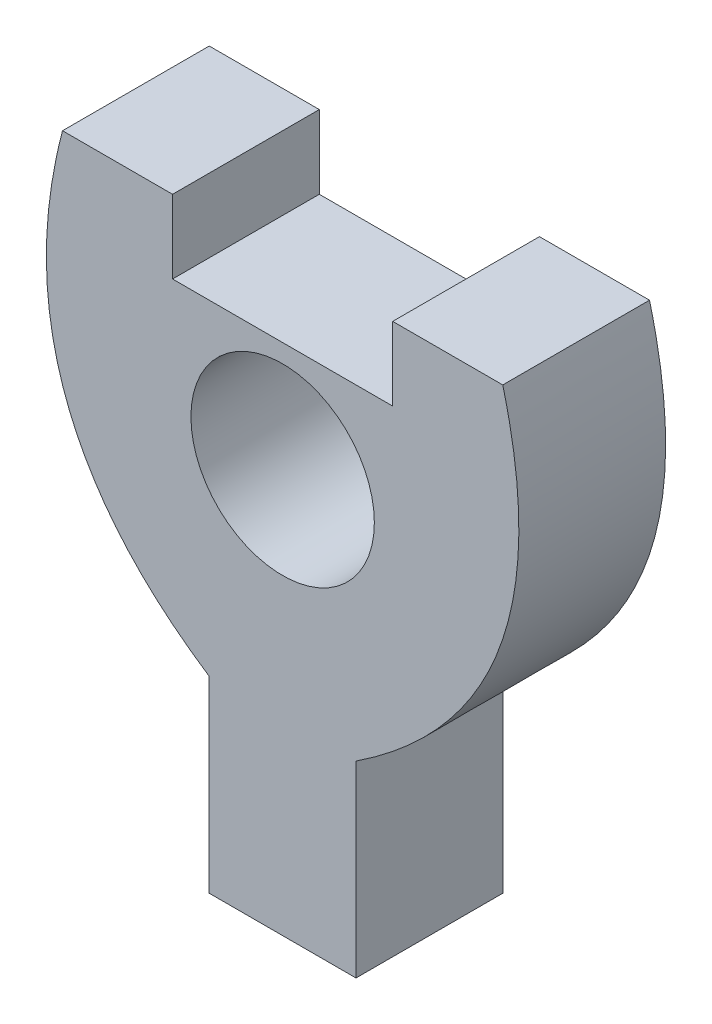
ISO-10303-21;
HEADER;
FILE_DESCRIPTION(('STEP AP214'),'2;1');
FILE_NAME('part.step','',(''),(''),'','','');
FILE_SCHEMA(('AUTOMOTIVE_DESIGN { 1 0 10303 214 1 1 1 1 }'));
ENDSEC;
DATA;
#1=APPLICATION_CONTEXT('core data for automotive mechanical design processes');
#2=APPLICATION_PROTOCOL_DEFINITION('international standard','automotive_design',2000,#1);
#3=PRODUCT_CONTEXT('',#1,'mechanical');
#4=PRODUCT('Part','Part','',(#3));
#5=PRODUCT_RELATED_PRODUCT_CATEGORY('part','',(#4));
#6=PRODUCT_DEFINITION_FORMATION('','',#4);
#7=PRODUCT_DEFINITION_CONTEXT('part definition',#1,'design');
#8=PRODUCT_DEFINITION('design','',#6,#7);
#9=PRODUCT_DEFINITION_SHAPE('','',#8);
#10=(LENGTH_UNIT() NAMED_UNIT(*) SI_UNIT(.MILLI.,.METRE.));
#11=(NAMED_UNIT(*) PLANE_ANGLE_UNIT() SI_UNIT($,.RADIAN.));
#12=(NAMED_UNIT(*) SI_UNIT($,.STERADIAN.) SOLID_ANGLE_UNIT());
#13=UNCERTAINTY_MEASURE_WITH_UNIT(LENGTH_MEASURE(1.E-05),#10,'distance_accuracy_value','');
#14=(GEOMETRIC_REPRESENTATION_CONTEXT(3) GLOBAL_UNCERTAINTY_ASSIGNED_CONTEXT((#13)) GLOBAL_UNIT_ASSIGNED_CONTEXT((#10,
#11,#12)) REPRESENTATION_CONTEXT('',''));
#15=CARTESIAN_POINT('',(0.,0.,0.));
#16=DIRECTION('',(0.,0.,1.));
#17=DIRECTION('',(1.,0.,0.));
#18=AXIS2_PLACEMENT_3D('',#15,#16,#17);
#19=CARTESIAN_POINT('',(0.,0.,4.));
#20=CARTESIAN_POINT('',(-8.12132034355964,3.87867965644036,4.));
#21=CARTESIAN_POINT('',(-6.,12.,4.));
#22=B_SPLINE_CURVE_WITH_KNOTS('',2,(#19,#20,#21),.UNSPECIFIED.,.F.,.F.,(3,3),(0.,1.),.UNSPECIFIED.);
#23=DIRECTION('',(0.,0.,-1.));
#24=VECTOR('',#23,1.);
#25=SURFACE_OF_LINEAR_EXTRUSION('',#22,#24);
#26=CARTESIAN_POINT('',(0.,0.,0.));
#27=CARTESIAN_POINT('',(-8.12132034355964,3.87867965644036,0.));
#28=CARTESIAN_POINT('',(-6.,12.,0.));
#29=B_SPLINE_CURVE_WITH_KNOTS('',2,(#26,#27,#28),.UNSPECIFIED.,.F.,.F.,(3,3),(0.,1.),.UNSPECIFIED.);
#30=CARTESIAN_POINT('',(-2.00000000009146,1.12054859730162,0.));
#31=VERTEX_POINT('',#30);
#32=CARTESIAN_POINT('',(-6.,12.,0.));
#33=VERTEX_POINT('',#32);
#34=EDGE_CURVE('E148',#31,#33,#29,.T.);
#35=ORIENTED_EDGE('',*,*,#34,.F.);
#36=DIRECTION('',(0.,0.,-1.));
#37=VECTOR('',#36,1.);
#38=CARTESIAN_POINT('',(-2.00000000009146,1.12054859730162,4.));
#39=LINE('',#38,#37);
#40=CARTESIAN_POINT('',(-2.00000000009146,1.12054859730162,4.));
#41=VERTEX_POINT('',#40);
#42=EDGE_CURVE('E11',#41,#31,#39,.T.);
#43=ORIENTED_EDGE('',*,*,#42,.F.);
#44=CARTESIAN_POINT('',(-6.,12.,4.));
#45=VERTEX_POINT('',#44);
#46=EDGE_CURVE('E184',#41,#45,#22,.T.);
#47=ORIENTED_EDGE('',*,*,#46,.T.);
#48=DIRECTION('',(0.,0.,-1.));
#49=VECTOR('',#48,1.);
#50=CARTESIAN_POINT('',(-6.,12.,4.));
#51=LINE('',#50,#49);
#52=EDGE_CURVE('E53',#45,#33,#51,.T.);
#53=ORIENTED_EDGE('',*,*,#52,.T.);
#54=EDGE_LOOP('',(#35,#43,#47,#53));
#55=FACE_BOUND('',#54,.T.);
#56=ADVANCED_FACE('F36',(#55),#25,.T.);
#57=CARTESIAN_POINT('',(-2.,0.,4.));
#58=DIRECTION('',(1.,0.,0.));
#59=DIRECTION('',(0.,1.,0.));
#60=AXIS2_PLACEMENT_3D('',#57,#58,#59);
#61=PLANE('',#60);
#62=DIRECTION('',(0.,-1.,0.));
#63=VECTOR('',#62,1.);
#64=CARTESIAN_POINT('',(-2.,0.,0.));
#65=LINE('',#64,#63);
#66=CARTESIAN_POINT('',(-2.,-4.,0.));
#67=VERTEX_POINT('',#66);
#68=EDGE_CURVE('E152',#31,#67,#65,.T.);
#69=ORIENTED_EDGE('',*,*,#68,.T.);
#70=DIRECTION('',(0.,0.,-1.));
#71=VECTOR('',#70,1.);
#72=CARTESIAN_POINT('',(-2.,-4.,4.));
#73=LINE('',#72,#71);
#74=CARTESIAN_POINT('',(-2.,-4.,4.));
#75=VERTEX_POINT('',#74);
#76=EDGE_CURVE('E45',#75,#67,#73,.T.);
#77=ORIENTED_EDGE('',*,*,#76,.F.);
#78=DIRECTION('',(0.,-1.,0.));
#79=VECTOR('',#78,1.);
#80=CARTESIAN_POINT('',(-2.,0.,4.));
#81=LINE('',#80,#79);
#82=EDGE_CURVE('E222',#41,#75,#81,.T.);
#83=ORIENTED_EDGE('',*,*,#82,.F.);
#84=ORIENTED_EDGE('',*,*,#42,.T.);
#85=EDGE_LOOP('',(#69,#77,#83,#84));
#86=FACE_BOUND('',#85,.T.);
#87=ADVANCED_FACE('F242',(#86),#61,.F.);
#88=CARTESIAN_POINT('',(0.,-4.,4.));
#89=DIRECTION('',(0.,1.,0.));
#90=DIRECTION('',(0.,0.,1.));
#91=AXIS2_PLACEMENT_3D('',#88,#89,#90);
#92=PLANE('',#91);
#93=DIRECTION('',(1.,0.,0.));
#94=VECTOR('',#93,1.);
#95=CARTESIAN_POINT('',(0.,-4.,0.));
#96=LINE('',#95,#94);
#97=CARTESIAN_POINT('',(2.,-4.,0.));
#98=VERTEX_POINT('',#97);
#99=EDGE_CURVE('E157',#67,#98,#96,.T.);
#100=ORIENTED_EDGE('',*,*,#99,.T.);
#101=DIRECTION('',(0.,0.,-1.));
#102=VECTOR('',#101,1.);
#103=CARTESIAN_POINT('',(2.,-4.,4.));
#104=LINE('',#103,#102);
#105=CARTESIAN_POINT('',(2.,-4.,4.));
#106=VERTEX_POINT('',#105);
#107=EDGE_CURVE('E196',#106,#98,#104,.T.);
#108=ORIENTED_EDGE('',*,*,#107,.F.);
#109=DIRECTION('',(1.,0.,0.));
#110=VECTOR('',#109,1.);
#111=CARTESIAN_POINT('',(0.,-4.,4.));
#112=LINE('',#111,#110);
#113=EDGE_CURVE('E204',#75,#106,#112,.T.);
#114=ORIENTED_EDGE('',*,*,#113,.F.);
#115=ORIENTED_EDGE('',*,*,#76,.T.);
#116=EDGE_LOOP('',(#100,#108,#114,#115));
#117=FACE_BOUND('',#116,.T.);
#118=ADVANCED_FACE('F202',(#117),#92,.F.);
#119=CARTESIAN_POINT('',(2.,0.,4.));
#120=DIRECTION('',(1.,0.,0.));
#121=DIRECTION('',(0.,1.,0.));
#122=AXIS2_PLACEMENT_3D('',#119,#120,#121);
#123=PLANE('',#122);
#124=DIRECTION('',(0.,-1.,0.));
#125=VECTOR('',#124,1.);
#126=CARTESIAN_POINT('',(2.,0.,0.));
#127=LINE('',#126,#125);
#128=CARTESIAN_POINT('',(2.00000000009145,1.12054859730162,0.));
#129=VERTEX_POINT('',#128);
#130=EDGE_CURVE('E160',#129,#98,#127,.T.);
#131=ORIENTED_EDGE('',*,*,#130,.F.);
#132=DIRECTION('',(0.,0.,-1.));
#133=VECTOR('',#132,1.);
#134=CARTESIAN_POINT('',(2.00000000009145,1.12054859730162,4.));
#135=LINE('',#134,#133);
#136=CARTESIAN_POINT('',(2.00000000009145,1.12054859730162,4.));
#137=VERTEX_POINT('',#136);
#138=EDGE_CURVE('E194',#137,#129,#135,.T.);
#139=ORIENTED_EDGE('',*,*,#138,.F.);
#140=DIRECTION('',(0.,-1.,0.));
#141=VECTOR('',#140,1.);
#142=CARTESIAN_POINT('',(2.,0.,4.));
#143=LINE('',#142,#141);
#144=EDGE_CURVE('E218',#137,#106,#143,.T.);
#145=ORIENTED_EDGE('',*,*,#144,.T.);
#146=ORIENTED_EDGE('',*,*,#107,.T.);
#147=EDGE_LOOP('',(#131,#139,#145,#146));
#148=FACE_BOUND('',#147,.T.);
#149=ADVANCED_FACE('F214',(#148),#123,.T.);
#150=CARTESIAN_POINT('',(0.,0.,4.));
#151=CARTESIAN_POINT('',(8.12132034355964,3.87867965644036,4.));
#152=CARTESIAN_POINT('',(6.,12.,4.));
#153=B_SPLINE_CURVE_WITH_KNOTS('',2,(#150,#151,#152),.UNSPECIFIED.,.F.,.F.,(3,3),(0.,1.),.UNSPECIFIED.);
#154=DIRECTION('',(0.,0.,-1.));
#155=VECTOR('',#154,1.);
#156=SURFACE_OF_LINEAR_EXTRUSION('',#153,#155);
#157=CARTESIAN_POINT('',(0.,0.,0.));
#158=CARTESIAN_POINT('',(8.12132034355964,3.87867965644036,0.));
#159=CARTESIAN_POINT('',(6.,12.,0.));
#160=B_SPLINE_CURVE_WITH_KNOTS('',2,(#157,#158,#159),.UNSPECIFIED.,.F.,.F.,(3,3),(0.,1.),.UNSPECIFIED.);
#161=CARTESIAN_POINT('',(6.,12.,0.));
#162=VERTEX_POINT('',#161);
#163=EDGE_CURVE('E163',#129,#162,#160,.T.);
#164=ORIENTED_EDGE('',*,*,#163,.T.);
#165=DIRECTION('',(0.,0.,-1.));
#166=VECTOR('',#165,1.);
#167=CARTESIAN_POINT('',(6.,12.,4.));
#168=LINE('',#167,#166);
#169=CARTESIAN_POINT('',(6.,12.,4.));
#170=VERTEX_POINT('',#169);
#171=EDGE_CURVE('E191',#170,#162,#168,.T.);
#172=ORIENTED_EDGE('',*,*,#171,.F.);
#173=EDGE_CURVE('E219',#137,#170,#153,.T.);
#174=ORIENTED_EDGE('',*,*,#173,.F.);
#175=ORIENTED_EDGE('',*,*,#138,.T.);
#176=EDGE_LOOP('',(#164,#172,#174,#175));
#177=FACE_BOUND('',#176,.T.);
#178=ADVANCED_FACE('F232',(#177),#156,.F.);
#179=CARTESIAN_POINT('',(0.,12.,4.));
#180=DIRECTION('',(0.,-1.,0.));
#181=DIRECTION('',(0.,0.,-1.));
#182=AXIS2_PLACEMENT_3D('',#179,#180,#181);
#183=PLANE('',#182);
#184=DIRECTION('',(-1.,0.,0.));
#185=VECTOR('',#184,1.);
#186=CARTESIAN_POINT('',(0.,12.,0.));
#187=LINE('',#186,#185);
#188=CARTESIAN_POINT('',(3.,12.,0.));
#189=VERTEX_POINT('',#188);
#190=EDGE_CURVE('E167',#162,#189,#187,.T.);
#191=ORIENTED_EDGE('',*,*,#190,.T.);
#192=DIRECTION('',(0.,0.,-1.));
#193=VECTOR('',#192,1.);
#194=CARTESIAN_POINT('',(3.,12.,4.));
#195=LINE('',#194,#193);
#196=CARTESIAN_POINT('',(3.,12.,4.));
#197=VERTEX_POINT('',#196);
#198=EDGE_CURVE('E188',#197,#189,#195,.T.);
#199=ORIENTED_EDGE('',*,*,#198,.F.);
#200=DIRECTION('',(-1.,0.,0.));
#201=VECTOR('',#200,1.);
#202=CARTESIAN_POINT('',(0.,12.,4.));
#203=LINE('',#202,#201);
#204=EDGE_CURVE('E140',#170,#197,#203,.T.);
#205=ORIENTED_EDGE('',*,*,#204,.F.);
#206=ORIENTED_EDGE('',*,*,#171,.T.);
#207=EDGE_LOOP('',(#191,#199,#205,#206));
#208=FACE_BOUND('',#207,.T.);
#209=ADVANCED_FACE('F236',(#208),#183,.F.);
#210=CARTESIAN_POINT('',(3.,0.,4.));
#211=DIRECTION('',(1.,0.,0.));
#212=DIRECTION('',(0.,0.,-1.));
#213=AXIS2_PLACEMENT_3D('',#210,#211,#212);
#214=PLANE('',#213);
#215=DIRECTION('',(0.,-1.,0.));
#216=VECTOR('',#215,1.);
#217=CARTESIAN_POINT('',(3.,0.,0.));
#218=LINE('',#217,#216);
#219=CARTESIAN_POINT('',(3.,10.,0.));
#220=VERTEX_POINT('',#219);
#221=EDGE_CURVE('E172',#189,#220,#218,.T.);
#222=ORIENTED_EDGE('',*,*,#221,.T.);
#223=DIRECTION('',(0.,0.,-1.));
#224=VECTOR('',#223,1.);
#225=CARTESIAN_POINT('',(3.,10.,4.));
#226=LINE('',#225,#224);
#227=CARTESIAN_POINT('',(3.,10.,4.));
#228=VERTEX_POINT('',#227);
#229=EDGE_CURVE('E125',#228,#220,#226,.T.);
#230=ORIENTED_EDGE('',*,*,#229,.F.);
#231=DIRECTION('',(0.,-1.,0.));
#232=VECTOR('',#231,1.);
#233=CARTESIAN_POINT('',(3.,0.,4.));
#234=LINE('',#233,#232);
#235=EDGE_CURVE('E137',#197,#228,#234,.T.);
#236=ORIENTED_EDGE('',*,*,#235,.F.);
#237=ORIENTED_EDGE('',*,*,#198,.T.);
#238=EDGE_LOOP('',(#222,#230,#236,#237));
#239=FACE_BOUND('',#238,.T.);
#240=ADVANCED_FACE('F267',(#239),#214,.F.);
#241=CARTESIAN_POINT('',(0.,10.,4.));
#242=DIRECTION('',(0.,1.,0.));
#243=DIRECTION('',(0.,0.,1.));
#244=AXIS2_PLACEMENT_3D('',#241,#242,#243);
#245=PLANE('',#244);
#246=DIRECTION('',(1.,0.,0.));
#247=VECTOR('',#246,1.);
#248=CARTESIAN_POINT('',(0.,10.,0.));
#249=LINE('',#248,#247);
#250=CARTESIAN_POINT('',(-3.,10.,0.));
#251=VERTEX_POINT('',#250);
#252=EDGE_CURVE('E122',#251,#220,#249,.T.);
#253=ORIENTED_EDGE('',*,*,#252,.F.);
#254=DIRECTION('',(0.,0.,-1.));
#255=VECTOR('',#254,1.);
#256=CARTESIAN_POINT('',(-3.,10.,4.));
#257=LINE('',#256,#255);
#258=CARTESIAN_POINT('',(-3.,10.,4.));
#259=VERTEX_POINT('',#258);
#260=EDGE_CURVE('E116',#259,#251,#257,.T.);
#261=ORIENTED_EDGE('',*,*,#260,.F.);
#262=DIRECTION('',(1.,0.,0.));
#263=VECTOR('',#262,1.);
#264=CARTESIAN_POINT('',(0.,10.,4.));
#265=LINE('',#264,#263);
#266=EDGE_CURVE('E120',#259,#228,#265,.T.);
#267=ORIENTED_EDGE('',*,*,#266,.T.);
#268=ORIENTED_EDGE('',*,*,#229,.T.);
#269=EDGE_LOOP('',(#253,#261,#267,#268));
#270=FACE_BOUND('',#269,.T.);
#271=ADVANCED_FACE('F118',(#270),#245,.T.);
#272=CARTESIAN_POINT('',(-3.,0.,4.));
#273=DIRECTION('',(-1.,0.,0.));
#274=DIRECTION('',(0.,0.,1.));
#275=AXIS2_PLACEMENT_3D('',#272,#273,#274);
#276=PLANE('',#275);
#277=DIRECTION('',(0.,1.,0.));
#278=VECTOR('',#277,1.);
#279=CARTESIAN_POINT('',(-3.,0.,0.));
#280=LINE('',#279,#278);
#281=CARTESIAN_POINT('',(-3.,12.,0.));
#282=VERTEX_POINT('',#281);
#283=EDGE_CURVE('E176',#251,#282,#280,.T.);
#284=ORIENTED_EDGE('',*,*,#283,.T.);
#285=DIRECTION('',(0.,0.,-1.));
#286=VECTOR('',#285,1.);
#287=CARTESIAN_POINT('',(-3.,12.,4.));
#288=LINE('',#287,#286);
#289=CARTESIAN_POINT('',(-3.,12.,4.));
#290=VERTEX_POINT('',#289);
#291=EDGE_CURVE('E85',#290,#282,#288,.T.);
#292=ORIENTED_EDGE('',*,*,#291,.F.);
#293=DIRECTION('',(0.,1.,0.));
#294=VECTOR('',#293,1.);
#295=CARTESIAN_POINT('',(-3.,0.,4.));
#296=LINE('',#295,#294);
#297=EDGE_CURVE('E127',#259,#290,#296,.T.);
#298=ORIENTED_EDGE('',*,*,#297,.F.);
#299=ORIENTED_EDGE('',*,*,#260,.T.);
#300=EDGE_LOOP('',(#284,#292,#298,#299));
#301=FACE_BOUND('',#300,.T.);
#302=ADVANCED_FACE('F128',(#301),#276,.F.);
#303=CARTESIAN_POINT('',(0.,12.,4.));
#304=DIRECTION('',(0.,1.,0.));
#305=DIRECTION('',(0.,0.,1.));
#306=AXIS2_PLACEMENT_3D('',#303,#304,#305);
#307=PLANE('',#306);
#308=DIRECTION('',(1.,0.,0.));
#309=VECTOR('',#308,1.);
#310=CARTESIAN_POINT('',(0.,12.,0.));
#311=LINE('',#310,#309);
#312=EDGE_CURVE('E178',#33,#282,#311,.T.);
#313=ORIENTED_EDGE('',*,*,#312,.F.);
#314=ORIENTED_EDGE('',*,*,#52,.F.);
#315=DIRECTION('',(1.,0.,0.));
#316=VECTOR('',#315,1.);
#317=CARTESIAN_POINT('',(0.,12.,4.));
#318=LINE('',#317,#316);
#319=EDGE_CURVE('E131',#45,#290,#318,.T.);
#320=ORIENTED_EDGE('',*,*,#319,.T.);
#321=ORIENTED_EDGE('',*,*,#291,.T.);
#322=EDGE_LOOP('',(#313,#314,#320,#321));
#323=FACE_BOUND('',#322,.T.);
#324=ADVANCED_FACE('F253',(#323),#307,.T.);
#325=CARTESIAN_POINT('',(0.,7.,4.));
#326=DIRECTION('',(0.,0.,-1.));
#327=DIRECTION('',(-1.,0.,0.));
#328=AXIS2_PLACEMENT_3D('',#325,#326,#327);
#329=CYLINDRICAL_SURFACE('',#328,2.5);
#330=CARTESIAN_POINT('',(0.,7.,4.));
#331=DIRECTION('',(0.,0.,1.));
#332=DIRECTION('',(1.,0.,0.));
#333=AXIS2_PLACEMENT_3D('',#330,#331,#332);
#334=CIRCLE('',#333,2.5);
#335=CARTESIAN_POINT('',(2.5,7.,4.));
#336=VERTEX_POINT('',#335);
#337=EDGE_CURVE('E145',#336,#336,#334,.T.);
#338=ORIENTED_EDGE('',*,*,#337,.T.);
#339=EDGE_LOOP('',(#338));
#340=FACE_BOUND('',#339,.T.);
#341=CARTESIAN_POINT('',(0.,7.,0.));
#342=DIRECTION('',(0.,0.,1.));
#343=DIRECTION('',(1.,0.,0.));
#344=AXIS2_PLACEMENT_3D('',#341,#342,#343);
#345=CIRCLE('',#344,2.5);
#346=CARTESIAN_POINT('',(2.5,7.,0.));
#347=VERTEX_POINT('',#346);
#348=EDGE_CURVE('E181',#347,#347,#345,.T.);
#349=ORIENTED_EDGE('',*,*,#348,.F.);
#350=EDGE_LOOP('',(#349));
#351=FACE_BOUND('',#350,.T.);
#352=ADVANCED_FACE('F255',(#340,#351),#329,.F.);
#353=CARTESIAN_POINT('',(0.,0.,4.));
#354=DIRECTION('',(0.,0.,1.));
#355=DIRECTION('',(1.,0.,0.));
#356=AXIS2_PLACEMENT_3D('',#353,#354,#355);
#357=PLANE('',#356);
#358=ORIENTED_EDGE('',*,*,#46,.F.);
#359=ORIENTED_EDGE('',*,*,#82,.T.);
#360=ORIENTED_EDGE('',*,*,#113,.T.);
#361=ORIENTED_EDGE('',*,*,#144,.F.);
#362=ORIENTED_EDGE('',*,*,#173,.T.);
#363=ORIENTED_EDGE('',*,*,#204,.T.);
#364=ORIENTED_EDGE('',*,*,#235,.T.);
#365=ORIENTED_EDGE('',*,*,#266,.F.);
#366=ORIENTED_EDGE('',*,*,#297,.T.);
#367=ORIENTED_EDGE('',*,*,#319,.F.);
#368=EDGE_LOOP('',(#358,#359,#360,#361,#362,#363,#364,#365,#366,#367));
#369=FACE_BOUND('',#368,.T.);
#370=ORIENTED_EDGE('',*,*,#337,.F.);
#371=EDGE_LOOP('',(#370));
#372=FACE_BOUND('',#371,.T.);
#373=ADVANCED_FACE('F134',(#369,#372),#357,.T.);
#374=CARTESIAN_POINT('',(0.,0.,0.));
#375=DIRECTION('',(0.,0.,1.));
#376=DIRECTION('',(1.,0.,0.));
#377=AXIS2_PLACEMENT_3D('',#374,#375,#376);
#378=PLANE('',#377);
#379=ORIENTED_EDGE('',*,*,#34,.T.);
#380=ORIENTED_EDGE('',*,*,#312,.T.);
#381=ORIENTED_EDGE('',*,*,#283,.F.);
#382=ORIENTED_EDGE('',*,*,#252,.T.);
#383=ORIENTED_EDGE('',*,*,#221,.F.);
#384=ORIENTED_EDGE('',*,*,#190,.F.);
#385=ORIENTED_EDGE('',*,*,#163,.F.);
#386=ORIENTED_EDGE('',*,*,#130,.T.);
#387=ORIENTED_EDGE('',*,*,#99,.F.);
#388=ORIENTED_EDGE('',*,*,#68,.F.);
#389=EDGE_LOOP('',(#379,#380,#381,#382,#383,#384,#385,#386,#387,#388));
#390=FACE_BOUND('',#389,.T.);
#391=ORIENTED_EDGE('',*,*,#348,.T.);
#392=EDGE_LOOP('',(#391));
#393=FACE_BOUND('',#392,.T.);
#394=ADVANCED_FACE('F208',(#390,#393),#378,.F.);
#395=CLOSED_SHELL('',(#56,#87,#118,#149,#178,#209,#240,#271,#302,#324,#352,#373,#394));
#396=MANIFOLD_SOLID_BREP('B2',#395);
#397=ADVANCED_BREP_SHAPE_REPRESENTATION('',(#18,#396),#14);
#398=SHAPE_DEFINITION_REPRESENTATION(#9,#397);
ENDSEC;
END-ISO-10303-21;
